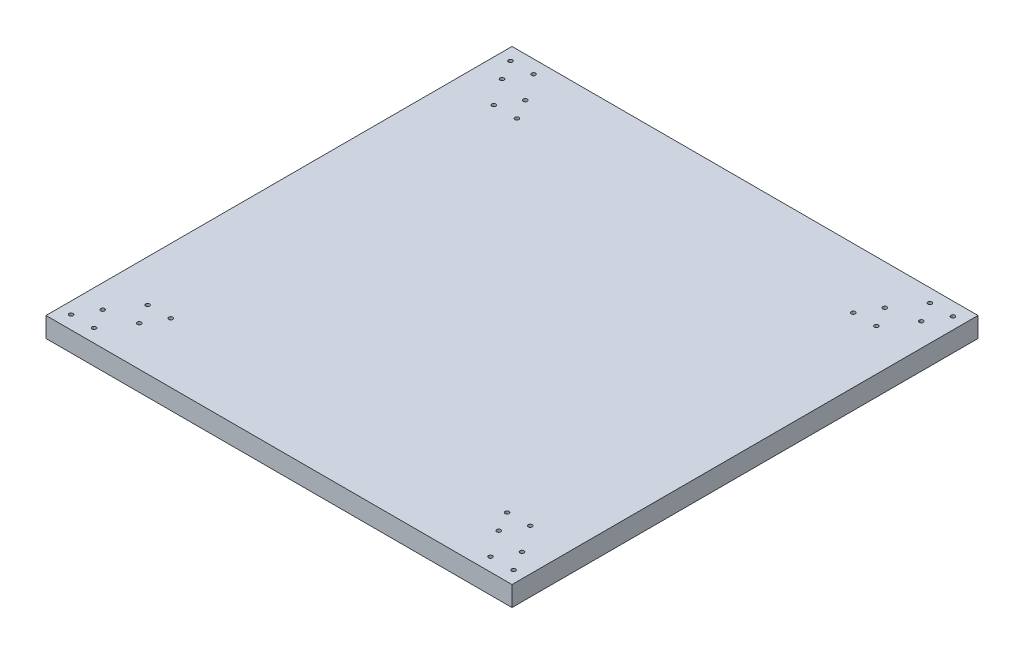
ISO-10303-21;
HEADER;
FILE_DESCRIPTION(('STEP AP214'),'2;1');
FILE_NAME('part.step','',(''),(''),'','','');
FILE_SCHEMA(('AUTOMOTIVE_DESIGN { 1 0 10303 214 1 1 1 1 }'));
ENDSEC;
DATA;
#1=APPLICATION_CONTEXT('core data for automotive mechanical design processes');
#2=APPLICATION_PROTOCOL_DEFINITION('international standard','automotive_design',2000,#1);
#3=PRODUCT_CONTEXT('',#1,'mechanical');
#4=PRODUCT('Part','Part','',(#3));
#5=PRODUCT_RELATED_PRODUCT_CATEGORY('part','',(#4));
#6=PRODUCT_DEFINITION_FORMATION('','',#4);
#7=PRODUCT_DEFINITION_CONTEXT('part definition',#1,'design');
#8=PRODUCT_DEFINITION('design','',#6,#7);
#9=PRODUCT_DEFINITION_SHAPE('','',#8);
#10=(LENGTH_UNIT() NAMED_UNIT(*) SI_UNIT(.MILLI.,.METRE.));
#11=(NAMED_UNIT(*) PLANE_ANGLE_UNIT() SI_UNIT($,.RADIAN.));
#12=(NAMED_UNIT(*) SI_UNIT($,.STERADIAN.) SOLID_ANGLE_UNIT());
#13=UNCERTAINTY_MEASURE_WITH_UNIT(LENGTH_MEASURE(1.E-05),#10,'distance_accuracy_value','');
#14=(GEOMETRIC_REPRESENTATION_CONTEXT(3) GLOBAL_UNCERTAINTY_ASSIGNED_CONTEXT((#13)) GLOBAL_UNIT_ASSIGNED_CONTEXT((#10,
#11,#12)) REPRESENTATION_CONTEXT('',''));
#15=CARTESIAN_POINT('',(0.,0.,0.));
#16=DIRECTION('',(0.,0.,1.));
#17=DIRECTION('',(1.,0.,0.));
#18=AXIS2_PLACEMENT_3D('',#15,#16,#17);
#19=CARTESIAN_POINT('',(0.,15.,0.));
#20=DIRECTION('',(0.,1.,0.));
#21=DIRECTION('',(0.,0.,1.));
#22=AXIS2_PLACEMENT_3D('',#19,#20,#21);
#23=PLANE('',#22);
#24=CARTESIAN_POINT('',(146.006098541866,15.,198.498659517427));
#25=DIRECTION('',(0.,1.,0.));
#26=DIRECTION('',(0.,0.,-1.));
#27=AXIS2_PLACEMENT_3D('',#24,#25,#26);
#28=CIRCLE('',#27,1.5);
#29=CARTESIAN_POINT('',(146.006098541866,15.,196.998659517427));
#30=VERTEX_POINT('',#29);
#31=EDGE_CURVE('E241',#30,#30,#28,.T.);
#32=ORIENTED_EDGE('',*,*,#31,.F.);
#33=EDGE_LOOP('',(#32));
#34=FACE_BOUND('',#33,.T.);
#35=CARTESIAN_POINT('',(-132.654155495978,15.,213.498659517426));
#36=DIRECTION('',(0.,1.,0.));
#37=DIRECTION('',(0.,0.,1.));
#38=AXIS2_PLACEMENT_3D('',#35,#36,#37);
#39=CIRCLE('',#38,1.5);
#40=CARTESIAN_POINT('',(-132.654155495978,15.,214.998659517426));
#41=VERTEX_POINT('',#40);
#42=EDGE_CURVE('E229',#41,#41,#39,.T.);
#43=ORIENTED_EDGE('',*,*,#42,.F.);
#44=EDGE_LOOP('',(#43));
#45=FACE_BOUND('',#44,.T.);
#46=CARTESIAN_POINT('',(146.006098541866,15.,-61.5013404825739));
#47=DIRECTION('',(0.,1.,0.));
#48=DIRECTION('',(0.,0.,1.));
#49=AXIS2_PLACEMENT_3D('',#46,#47,#48);
#50=CIRCLE('',#49,1.5);
#51=CARTESIAN_POINT('',(146.006098541866,15.,-60.0013404825739));
#52=VERTEX_POINT('',#51);
#53=EDGE_CURVE('E217',#52,#52,#50,.T.);
#54=ORIENTED_EDGE('',*,*,#53,.F.);
#55=EDGE_LOOP('',(#54));
#56=FACE_BOUND('',#55,.T.);
#57=CARTESIAN_POINT('',(137.345844504021,15.,-76.5013404825737));
#58=DIRECTION('',(0.,1.,0.));
#59=DIRECTION('',(0.,0.,1.));
#60=AXIS2_PLACEMENT_3D('',#57,#58,#59);
#61=CIRCLE('',#60,1.5);
#62=CARTESIAN_POINT('',(137.345844504021,15.,-75.0013404825737));
#63=VERTEX_POINT('',#62);
#64=EDGE_CURVE('E205',#63,#63,#61,.T.);
#65=ORIENTED_EDGE('',*,*,#64,.F.);
#66=EDGE_LOOP('',(#65));
#67=FACE_BOUND('',#66,.T.);
#68=CARTESIAN_POINT('',(-132.654155495979,15.,-76.5013404825737));
#69=DIRECTION('',(0.,1.,0.));
#70=DIRECTION('',(0.,0.,-1.));
#71=AXIS2_PLACEMENT_3D('',#68,#69,#70);
#72=CIRCLE('',#71,1.5);
#73=CARTESIAN_POINT('',(-132.654155495979,15.,-78.0013404825737));
#74=VERTEX_POINT('',#73);
#75=EDGE_CURVE('E193',#74,#74,#72,.T.);
#76=ORIENTED_EDGE('',*,*,#75,.F.);
#77=EDGE_LOOP('',(#76));
#78=FACE_BOUND('',#77,.T.);
#79=CARTESIAN_POINT('',(-123.993901458134,15.,-61.5013404825735));
#80=DIRECTION('',(0.,1.,0.));
#81=DIRECTION('',(0.,0.,-1.));
#82=AXIS2_PLACEMENT_3D('',#79,#80,#81);
#83=CIRCLE('',#82,1.49999999999999);
#84=CARTESIAN_POINT('',(-123.993901458134,15.,-63.0013404825735));
#85=VERTEX_POINT('',#84);
#86=EDGE_CURVE('E181',#85,#85,#83,.T.);
#87=ORIENTED_EDGE('',*,*,#86,.F.);
#88=EDGE_LOOP('',(#87));
#89=FACE_BOUND('',#88,.T.);
#90=CARTESIAN_POINT('',(-146.493901458134,15.,233.498659517426));
#91=DIRECTION('',(0.,1.,0.));
#92=DIRECTION('',(0.,0.,-1.));
#93=AXIS2_PLACEMENT_3D('',#90,#91,#92);
#94=CIRCLE('',#93,1.49999999999999);
#95=CARTESIAN_POINT('',(-146.493901458134,15.,231.998659517427));
#96=VERTEX_POINT('',#95);
#97=EDGE_CURVE('E169',#96,#96,#94,.T.);
#98=ORIENTED_EDGE('',*,*,#97,.F.);
#99=EDGE_LOOP('',(#98));
#100=FACE_BOUND('',#99,.T.);
#101=CARTESIAN_POINT('',(-155.154155495979,15.,-81.5013404825737));
#102=DIRECTION('',(0.,1.,0.));
#103=DIRECTION('',(0.,0.,1.));
#104=AXIS2_PLACEMENT_3D('',#101,#102,#103);
#105=CIRCLE('',#104,1.50000000000002);
#106=CARTESIAN_POINT('',(-155.154155495979,15.,-80.0013404825737));
#107=VERTEX_POINT('',#106);
#108=EDGE_CURVE('E157',#107,#107,#105,.T.);
#109=ORIENTED_EDGE('',*,*,#108,.F.);
#110=EDGE_LOOP('',(#109));
#111=FACE_BOUND('',#110,.T.);
#112=CARTESIAN_POINT('',(-163.814409533823,15.,-96.5013404825735));
#113=DIRECTION('',(0.,1.,0.));
#114=DIRECTION('',(0.,0.,1.));
#115=AXIS2_PLACEMENT_3D('',#112,#113,#114);
#116=CIRCLE('',#115,1.50000000000003);
#117=CARTESIAN_POINT('',(-163.814409533823,15.,-95.0013404825734));
#118=VERTEX_POINT('',#117);
#119=EDGE_CURVE('E145',#118,#118,#116,.T.);
#120=ORIENTED_EDGE('',*,*,#119,.F.);
#121=EDGE_LOOP('',(#120));
#122=FACE_BOUND('',#121,.T.);
#123=CARTESIAN_POINT('',(151.185590466177,15.,233.498659517426));
#124=DIRECTION('',(0.,1.,0.));
#125=DIRECTION('',(0.,0.,1.));
#126=AXIS2_PLACEMENT_3D('',#123,#124,#125);
#127=CIRCLE('',#126,1.49999999999999);
#128=CARTESIAN_POINT('',(151.185590466177,15.,234.998659517426));
#129=VERTEX_POINT('',#128);
#130=EDGE_CURVE('E133',#129,#129,#127,.T.);
#131=ORIENTED_EDGE('',*,*,#130,.F.);
#132=EDGE_LOOP('',(#131));
#133=FACE_BOUND('',#132,.T.);
#134=CARTESIAN_POINT('',(159.845844504021,15.,-81.5013404825737));
#135=DIRECTION('',(0.,1.,0.));
#136=DIRECTION('',(0.,0.,-1.));
#137=AXIS2_PLACEMENT_3D('',#134,#135,#136);
#138=CIRCLE('',#137,1.50000000000002);
#139=CARTESIAN_POINT('',(159.845844504021,15.,-83.0013404825737));
#140=VERTEX_POINT('',#139);
#141=EDGE_CURVE('E121',#140,#140,#138,.T.);
#142=ORIENTED_EDGE('',*,*,#141,.F.);
#143=EDGE_LOOP('',(#142));
#144=FACE_BOUND('',#143,.T.);
#145=CARTESIAN_POINT('',(159.845844504021,15.,218.498659517426));
#146=DIRECTION('',(0.,1.,0.));
#147=DIRECTION('',(0.,0.,1.));
#148=AXIS2_PLACEMENT_3D('',#145,#146,#147);
#149=CIRCLE('',#148,1.5);
#150=CARTESIAN_POINT('',(159.845844504021,15.,219.998659517426));
#151=VERTEX_POINT('',#150);
#152=EDGE_CURVE('E100',#151,#151,#149,.T.);
#153=ORIENTED_EDGE('',*,*,#152,.F.);
#154=EDGE_LOOP('',(#153));
#155=FACE_BOUND('',#154,.T.);
#156=DIRECTION('',(0.,0.,1.));
#157=VECTOR('',#156,1.);
#158=CARTESIAN_POINT('',(-172.654155495979,15.,-106.501340482574));
#159=LINE('',#158,#157);
#160=CARTESIAN_POINT('',(-172.654155495979,15.,-106.501340482574));
#161=VERTEX_POINT('',#160);
#162=CARTESIAN_POINT('',(-172.654155495979,15.,243.498659517426));
#163=VERTEX_POINT('',#162);
#164=EDGE_CURVE('E85',#161,#163,#159,.T.);
#165=ORIENTED_EDGE('',*,*,#164,.T.);
#166=DIRECTION('',(1.,0.,0.));
#167=VECTOR('',#166,1.);
#168=CARTESIAN_POINT('',(-172.654155495979,15.,243.498659517426));
#169=LINE('',#168,#167);
#170=CARTESIAN_POINT('',(177.345844504021,15.,243.498659517426));
#171=VERTEX_POINT('',#170);
#172=EDGE_CURVE('E80',#163,#171,#169,.T.);
#173=ORIENTED_EDGE('',*,*,#172,.T.);
#174=DIRECTION('',(0.,0.,-1.));
#175=VECTOR('',#174,1.);
#176=CARTESIAN_POINT('',(177.345844504021,15.,-106.501340482574));
#177=LINE('',#176,#175);
#178=CARTESIAN_POINT('',(177.345844504021,15.,-106.501340482574));
#179=VERTEX_POINT('',#178);
#180=EDGE_CURVE('E83',#171,#179,#177,.T.);
#181=ORIENTED_EDGE('',*,*,#180,.T.);
#182=DIRECTION('',(-1.,0.,0.));
#183=VECTOR('',#182,1.);
#184=CARTESIAN_POINT('',(-172.654155495979,15.,-106.501340482574));
#185=LINE('',#184,#183);
#186=EDGE_CURVE('E50',#179,#161,#185,.T.);
#187=ORIENTED_EDGE('',*,*,#186,.T.);
#188=EDGE_LOOP('',(#165,#173,#181,#187));
#189=FACE_BOUND('',#188,.T.);
#190=CARTESIAN_POINT('',(168.506098541866,15.,-96.5013404825735));
#191=DIRECTION('',(0.,1.,0.));
#192=DIRECTION('',(0.,0.,-1.));
#193=AXIS2_PLACEMENT_3D('',#190,#191,#192);
#194=CIRCLE('',#193,1.50000000000003);
#195=CARTESIAN_POINT('',(168.506098541866,15.,-98.0013404825735));
#196=VERTEX_POINT('',#195);
#197=EDGE_CURVE('E115',#196,#196,#194,.T.);
#198=ORIENTED_EDGE('',*,*,#197,.F.);
#199=EDGE_LOOP('',(#198));
#200=FACE_BOUND('',#199,.T.);
#201=CARTESIAN_POINT('',(168.506098541866,15.,233.498659517426));
#202=DIRECTION('',(0.,1.,0.));
#203=DIRECTION('',(0.,0.,1.));
#204=AXIS2_PLACEMENT_3D('',#201,#202,#203);
#205=CIRCLE('',#204,1.50000000000003);
#206=CARTESIAN_POINT('',(168.506098541866,15.,234.998659517426));
#207=VERTEX_POINT('',#206);
#208=EDGE_CURVE('E127',#207,#207,#205,.T.);
#209=ORIENTED_EDGE('',*,*,#208,.F.);
#210=EDGE_LOOP('',(#209));
#211=FACE_BOUND('',#210,.T.);
#212=CARTESIAN_POINT('',(151.185590466177,15.,-96.5013404825739));
#213=DIRECTION('',(0.,1.,0.));
#214=DIRECTION('',(0.,0.,-1.));
#215=AXIS2_PLACEMENT_3D('',#212,#213,#214);
#216=CIRCLE('',#215,1.49999999999997);
#217=CARTESIAN_POINT('',(151.185590466177,15.,-98.0013404825738));
#218=VERTEX_POINT('',#217);
#219=EDGE_CURVE('E139',#218,#218,#216,.T.);
#220=ORIENTED_EDGE('',*,*,#219,.F.);
#221=EDGE_LOOP('',(#220));
#222=FACE_BOUND('',#221,.T.);
#223=CARTESIAN_POINT('',(-146.493901458134,15.,-96.5013404825739));
#224=DIRECTION('',(0.,1.,0.));
#225=DIRECTION('',(0.,0.,1.));
#226=AXIS2_PLACEMENT_3D('',#223,#224,#225);
#227=CIRCLE('',#226,1.49999999999997);
#228=CARTESIAN_POINT('',(-146.493901458134,15.,-95.0013404825739));
#229=VERTEX_POINT('',#228);
#230=EDGE_CURVE('E151',#229,#229,#227,.T.);
#231=ORIENTED_EDGE('',*,*,#230,.F.);
#232=EDGE_LOOP('',(#231));
#233=FACE_BOUND('',#232,.T.);
#234=CARTESIAN_POINT('',(-155.154155495979,15.,218.498659517426));
#235=DIRECTION('',(0.,1.,0.));
#236=DIRECTION('',(0.,0.,-1.));
#237=AXIS2_PLACEMENT_3D('',#234,#235,#236);
#238=CIRCLE('',#237,1.5);
#239=CARTESIAN_POINT('',(-155.154155495979,15.,216.998659517426));
#240=VERTEX_POINT('',#239);
#241=EDGE_CURVE('E163',#240,#240,#238,.T.);
#242=ORIENTED_EDGE('',*,*,#241,.F.);
#243=EDGE_LOOP('',(#242));
#244=FACE_BOUND('',#243,.T.);
#245=CARTESIAN_POINT('',(-163.814409533823,15.,233.498659517426));
#246=DIRECTION('',(0.,1.,0.));
#247=DIRECTION('',(0.,0.,-1.));
#248=AXIS2_PLACEMENT_3D('',#245,#246,#247);
#249=CIRCLE('',#248,1.50000000000003);
#250=CARTESIAN_POINT('',(-163.814409533823,15.,231.998659517426));
#251=VERTEX_POINT('',#250);
#252=EDGE_CURVE('E175',#251,#251,#249,.T.);
#253=ORIENTED_EDGE('',*,*,#252,.F.);
#254=EDGE_LOOP('',(#253));
#255=FACE_BOUND('',#254,.T.);
#256=CARTESIAN_POINT('',(-141.314409533823,15.,-61.5013404825739));
#257=DIRECTION('',(0.,1.,0.));
#258=DIRECTION('',(0.,0.,-1.));
#259=AXIS2_PLACEMENT_3D('',#256,#257,#258);
#260=CIRCLE('',#259,1.5);
#261=CARTESIAN_POINT('',(-141.314409533823,15.,-63.0013404825739));
#262=VERTEX_POINT('',#261);
#263=EDGE_CURVE('E187',#262,#262,#260,.T.);
#264=ORIENTED_EDGE('',*,*,#263,.F.);
#265=EDGE_LOOP('',(#264));
#266=FACE_BOUND('',#265,.T.);
#267=CARTESIAN_POINT('',(-141.314409533823,15.,198.498659517427));
#268=DIRECTION('',(0.,1.,0.));
#269=DIRECTION('',(0.,0.,1.));
#270=AXIS2_PLACEMENT_3D('',#267,#268,#269);
#271=CIRCLE('',#270,1.5);
#272=CARTESIAN_POINT('',(-141.314409533823,15.,199.998659517427));
#273=VERTEX_POINT('',#272);
#274=EDGE_CURVE('E199',#273,#273,#271,.T.);
#275=ORIENTED_EDGE('',*,*,#274,.F.);
#276=EDGE_LOOP('',(#275));
#277=FACE_BOUND('',#276,.T.);
#278=CARTESIAN_POINT('',(-123.993901458134,15.,198.498659517426));
#279=DIRECTION('',(0.,1.,0.));
#280=DIRECTION('',(0.,0.,1.));
#281=AXIS2_PLACEMENT_3D('',#278,#279,#280);
#282=CIRCLE('',#281,1.49999999999999);
#283=CARTESIAN_POINT('',(-123.993901458134,15.,199.998659517426));
#284=VERTEX_POINT('',#283);
#285=EDGE_CURVE('E211',#284,#284,#282,.T.);
#286=ORIENTED_EDGE('',*,*,#285,.F.);
#287=EDGE_LOOP('',(#286));
#288=FACE_BOUND('',#287,.T.);
#289=CARTESIAN_POINT('',(128.685590466177,15.,-61.5013404825735));
#290=DIRECTION('',(0.,1.,0.));
#291=DIRECTION('',(0.,0.,1.));
#292=AXIS2_PLACEMENT_3D('',#289,#290,#291);
#293=CIRCLE('',#292,1.49999999999999);
#294=CARTESIAN_POINT('',(128.685590466177,15.,-60.0013404825735));
#295=VERTEX_POINT('',#294);
#296=EDGE_CURVE('E223',#295,#295,#293,.T.);
#297=ORIENTED_EDGE('',*,*,#296,.F.);
#298=EDGE_LOOP('',(#297));
#299=FACE_BOUND('',#298,.T.);
#300=CARTESIAN_POINT('',(128.685590466177,15.,198.498659517426));
#301=DIRECTION('',(0.,1.,0.));
#302=DIRECTION('',(0.,0.,-1.));
#303=AXIS2_PLACEMENT_3D('',#300,#301,#302);
#304=CIRCLE('',#303,1.49999999999999);
#305=CARTESIAN_POINT('',(128.685590466177,15.,196.998659517426));
#306=VERTEX_POINT('',#305);
#307=EDGE_CURVE('E235',#306,#306,#304,.T.);
#308=ORIENTED_EDGE('',*,*,#307,.F.);
#309=EDGE_LOOP('',(#308));
#310=FACE_BOUND('',#309,.T.);
#311=CARTESIAN_POINT('',(137.345844504022,15.,213.498659517426));
#312=DIRECTION('',(0.,1.,0.));
#313=DIRECTION('',(0.,0.,-1.));
#314=AXIS2_PLACEMENT_3D('',#311,#312,#313);
#315=CIRCLE('',#314,1.5);
#316=CARTESIAN_POINT('',(137.345844504022,15.,211.998659517426));
#317=VERTEX_POINT('',#316);
#318=EDGE_CURVE('E247',#317,#317,#315,.T.);
#319=ORIENTED_EDGE('',*,*,#318,.F.);
#320=EDGE_LOOP('',(#319));
#321=FACE_BOUND('',#320,.T.);
#322=ADVANCED_FACE('F33',(#34,#45,#56,#67,#78,#89,#100,#111,#122,#133,#144,#155,#189,#200,#211,
#222,#233,#244,#255,#266,#277,#288,#299,#310,#321),#23,.T.);
#323=CARTESIAN_POINT('',(0.,0.,0.));
#324=DIRECTION('',(0.,1.,0.));
#325=DIRECTION('',(0.,0.,1.));
#326=AXIS2_PLACEMENT_3D('',#323,#324,#325);
#327=PLANE('',#326);
#328=DIRECTION('',(0.,0.,1.));
#329=VECTOR('',#328,1.);
#330=CARTESIAN_POINT('',(-172.654155495979,0.,-106.501340482574));
#331=LINE('',#330,#329);
#332=CARTESIAN_POINT('',(-172.654155495979,0.,-106.501340482574));
#333=VERTEX_POINT('',#332);
#334=CARTESIAN_POINT('',(-172.654155495979,0.,243.498659517426));
#335=VERTEX_POINT('',#334);
#336=EDGE_CURVE('E97',#333,#335,#331,.T.);
#337=ORIENTED_EDGE('',*,*,#336,.F.);
#338=DIRECTION('',(-1.,0.,0.));
#339=VECTOR('',#338,1.);
#340=CARTESIAN_POINT('',(-172.654155495979,0.,-106.501340482574));
#341=LINE('',#340,#339);
#342=CARTESIAN_POINT('',(177.345844504021,0.,-106.501340482574));
#343=VERTEX_POINT('',#342);
#344=EDGE_CURVE('E73',#343,#333,#341,.T.);
#345=ORIENTED_EDGE('',*,*,#344,.F.);
#346=DIRECTION('',(0.,0.,-1.));
#347=VECTOR('',#346,1.);
#348=CARTESIAN_POINT('',(177.345844504021,0.,-106.501340482574));
#349=LINE('',#348,#347);
#350=CARTESIAN_POINT('',(177.345844504021,0.,243.498659517426));
#351=VERTEX_POINT('',#350);
#352=EDGE_CURVE('E67',#351,#343,#349,.T.);
#353=ORIENTED_EDGE('',*,*,#352,.F.);
#354=DIRECTION('',(1.,0.,0.));
#355=VECTOR('',#354,1.);
#356=CARTESIAN_POINT('',(-172.654155495979,0.,243.498659517426));
#357=LINE('',#356,#355);
#358=EDGE_CURVE('E89',#335,#351,#357,.T.);
#359=ORIENTED_EDGE('',*,*,#358,.F.);
#360=EDGE_LOOP('',(#337,#345,#353,#359));
#361=FACE_BOUND('',#360,.T.);
#362=CARTESIAN_POINT('',(159.845844504021,0.,218.498659517426));
#363=DIRECTION('',(0.,1.,0.));
#364=DIRECTION('',(0.,0.,1.));
#365=AXIS2_PLACEMENT_3D('',#362,#363,#364);
#366=CIRCLE('',#365,1.5);
#367=CARTESIAN_POINT('',(159.845844504021,0.,219.998659517426));
#368=VERTEX_POINT('',#367);
#369=EDGE_CURVE('E112',#368,#368,#366,.T.);
#370=ORIENTED_EDGE('',*,*,#369,.T.);
#371=EDGE_LOOP('',(#370));
#372=FACE_BOUND('',#371,.T.);
#373=CARTESIAN_POINT('',(168.506098541866,0.,-96.5013404825735));
#374=DIRECTION('',(0.,1.,0.));
#375=DIRECTION('',(0.,0.,-1.));
#376=AXIS2_PLACEMENT_3D('',#373,#374,#375);
#377=CIRCLE('',#376,1.50000000000003);
#378=CARTESIAN_POINT('',(168.506098541866,0.,-98.0013404825735));
#379=VERTEX_POINT('',#378);
#380=EDGE_CURVE('E118',#379,#379,#377,.T.);
#381=ORIENTED_EDGE('',*,*,#380,.T.);
#382=EDGE_LOOP('',(#381));
#383=FACE_BOUND('',#382,.T.);
#384=CARTESIAN_POINT('',(159.845844504021,0.,-81.5013404825737));
#385=DIRECTION('',(0.,1.,0.));
#386=DIRECTION('',(0.,0.,-1.));
#387=AXIS2_PLACEMENT_3D('',#384,#385,#386);
#388=CIRCLE('',#387,1.50000000000002);
#389=CARTESIAN_POINT('',(159.845844504021,0.,-83.0013404825737));
#390=VERTEX_POINT('',#389);
#391=EDGE_CURVE('E124',#390,#390,#388,.T.);
#392=ORIENTED_EDGE('',*,*,#391,.T.);
#393=EDGE_LOOP('',(#392));
#394=FACE_BOUND('',#393,.T.);
#395=CARTESIAN_POINT('',(168.506098541866,0.,233.498659517426));
#396=DIRECTION('',(0.,1.,0.));
#397=DIRECTION('',(0.,0.,1.));
#398=AXIS2_PLACEMENT_3D('',#395,#396,#397);
#399=CIRCLE('',#398,1.50000000000003);
#400=CARTESIAN_POINT('',(168.506098541866,0.,234.998659517426));
#401=VERTEX_POINT('',#400);
#402=EDGE_CURVE('E130',#401,#401,#399,.T.);
#403=ORIENTED_EDGE('',*,*,#402,.T.);
#404=EDGE_LOOP('',(#403));
#405=FACE_BOUND('',#404,.T.);
#406=CARTESIAN_POINT('',(151.185590466177,0.,233.498659517426));
#407=DIRECTION('',(0.,1.,0.));
#408=DIRECTION('',(0.,0.,1.));
#409=AXIS2_PLACEMENT_3D('',#406,#407,#408);
#410=CIRCLE('',#409,1.49999999999999);
#411=CARTESIAN_POINT('',(151.185590466177,0.,234.998659517426));
#412=VERTEX_POINT('',#411);
#413=EDGE_CURVE('E136',#412,#412,#410,.T.);
#414=ORIENTED_EDGE('',*,*,#413,.T.);
#415=EDGE_LOOP('',(#414));
#416=FACE_BOUND('',#415,.T.);
#417=CARTESIAN_POINT('',(151.185590466177,0.,-96.5013404825739));
#418=DIRECTION('',(0.,1.,0.));
#419=DIRECTION('',(0.,0.,-1.));
#420=AXIS2_PLACEMENT_3D('',#417,#418,#419);
#421=CIRCLE('',#420,1.49999999999997);
#422=CARTESIAN_POINT('',(151.185590466177,0.,-98.0013404825738));
#423=VERTEX_POINT('',#422);
#424=EDGE_CURVE('E142',#423,#423,#421,.T.);
#425=ORIENTED_EDGE('',*,*,#424,.T.);
#426=EDGE_LOOP('',(#425));
#427=FACE_BOUND('',#426,.T.);
#428=CARTESIAN_POINT('',(-163.814409533823,0.,-96.5013404825735));
#429=DIRECTION('',(0.,1.,0.));
#430=DIRECTION('',(0.,0.,1.));
#431=AXIS2_PLACEMENT_3D('',#428,#429,#430);
#432=CIRCLE('',#431,1.50000000000003);
#433=CARTESIAN_POINT('',(-163.814409533823,0.,-95.0013404825734));
#434=VERTEX_POINT('',#433);
#435=EDGE_CURVE('E148',#434,#434,#432,.T.);
#436=ORIENTED_EDGE('',*,*,#435,.T.);
#437=EDGE_LOOP('',(#436));
#438=FACE_BOUND('',#437,.T.);
#439=CARTESIAN_POINT('',(-146.493901458134,0.,-96.5013404825739));
#440=DIRECTION('',(0.,1.,0.));
#441=DIRECTION('',(0.,0.,1.));
#442=AXIS2_PLACEMENT_3D('',#439,#440,#441);
#443=CIRCLE('',#442,1.49999999999997);
#444=CARTESIAN_POINT('',(-146.493901458134,0.,-95.0013404825739));
#445=VERTEX_POINT('',#444);
#446=EDGE_CURVE('E154',#445,#445,#443,.T.);
#447=ORIENTED_EDGE('',*,*,#446,.T.);
#448=EDGE_LOOP('',(#447));
#449=FACE_BOUND('',#448,.T.);
#450=CARTESIAN_POINT('',(-155.154155495979,0.,-81.5013404825737));
#451=DIRECTION('',(0.,1.,0.));
#452=DIRECTION('',(0.,0.,1.));
#453=AXIS2_PLACEMENT_3D('',#450,#451,#452);
#454=CIRCLE('',#453,1.50000000000002);
#455=CARTESIAN_POINT('',(-155.154155495979,0.,-80.0013404825737));
#456=VERTEX_POINT('',#455);
#457=EDGE_CURVE('E160',#456,#456,#454,.T.);
#458=ORIENTED_EDGE('',*,*,#457,.T.);
#459=EDGE_LOOP('',(#458));
#460=FACE_BOUND('',#459,.T.);
#461=CARTESIAN_POINT('',(-155.154155495979,0.,218.498659517426));
#462=DIRECTION('',(0.,1.,0.));
#463=DIRECTION('',(0.,0.,-1.));
#464=AXIS2_PLACEMENT_3D('',#461,#462,#463);
#465=CIRCLE('',#464,1.5);
#466=CARTESIAN_POINT('',(-155.154155495979,0.,216.998659517426));
#467=VERTEX_POINT('',#466);
#468=EDGE_CURVE('E166',#467,#467,#465,.T.);
#469=ORIENTED_EDGE('',*,*,#468,.T.);
#470=EDGE_LOOP('',(#469));
#471=FACE_BOUND('',#470,.T.);
#472=CARTESIAN_POINT('',(-146.493901458134,0.,233.498659517426));
#473=DIRECTION('',(0.,1.,0.));
#474=DIRECTION('',(0.,0.,-1.));
#475=AXIS2_PLACEMENT_3D('',#472,#473,#474);
#476=CIRCLE('',#475,1.49999999999999);
#477=CARTESIAN_POINT('',(-146.493901458134,0.,231.998659517427));
#478=VERTEX_POINT('',#477);
#479=EDGE_CURVE('E172',#478,#478,#476,.T.);
#480=ORIENTED_EDGE('',*,*,#479,.T.);
#481=EDGE_LOOP('',(#480));
#482=FACE_BOUND('',#481,.T.);
#483=CARTESIAN_POINT('',(-163.814409533823,0.,233.498659517426));
#484=DIRECTION('',(0.,1.,0.));
#485=DIRECTION('',(0.,0.,-1.));
#486=AXIS2_PLACEMENT_3D('',#483,#484,#485);
#487=CIRCLE('',#486,1.50000000000003);
#488=CARTESIAN_POINT('',(-163.814409533823,0.,231.998659517426));
#489=VERTEX_POINT('',#488);
#490=EDGE_CURVE('E178',#489,#489,#487,.T.);
#491=ORIENTED_EDGE('',*,*,#490,.T.);
#492=EDGE_LOOP('',(#491));
#493=FACE_BOUND('',#492,.T.);
#494=CARTESIAN_POINT('',(-123.993901458134,0.,-61.5013404825735));
#495=DIRECTION('',(0.,1.,0.));
#496=DIRECTION('',(0.,0.,-1.));
#497=AXIS2_PLACEMENT_3D('',#494,#495,#496);
#498=CIRCLE('',#497,1.49999999999999);
#499=CARTESIAN_POINT('',(-123.993901458134,0.,-63.0013404825735));
#500=VERTEX_POINT('',#499);
#501=EDGE_CURVE('E184',#500,#500,#498,.T.);
#502=ORIENTED_EDGE('',*,*,#501,.T.);
#503=EDGE_LOOP('',(#502));
#504=FACE_BOUND('',#503,.T.);
#505=CARTESIAN_POINT('',(-141.314409533823,0.,-61.5013404825739));
#506=DIRECTION('',(0.,1.,0.));
#507=DIRECTION('',(0.,0.,-1.));
#508=AXIS2_PLACEMENT_3D('',#505,#506,#507);
#509=CIRCLE('',#508,1.5);
#510=CARTESIAN_POINT('',(-141.314409533823,0.,-63.0013404825739));
#511=VERTEX_POINT('',#510);
#512=EDGE_CURVE('E190',#511,#511,#509,.T.);
#513=ORIENTED_EDGE('',*,*,#512,.T.);
#514=EDGE_LOOP('',(#513));
#515=FACE_BOUND('',#514,.T.);
#516=CARTESIAN_POINT('',(-132.654155495979,0.,-76.5013404825737));
#517=DIRECTION('',(0.,1.,0.));
#518=DIRECTION('',(0.,0.,-1.));
#519=AXIS2_PLACEMENT_3D('',#516,#517,#518);
#520=CIRCLE('',#519,1.5);
#521=CARTESIAN_POINT('',(-132.654155495979,0.,-78.0013404825737));
#522=VERTEX_POINT('',#521);
#523=EDGE_CURVE('E196',#522,#522,#520,.T.);
#524=ORIENTED_EDGE('',*,*,#523,.T.);
#525=EDGE_LOOP('',(#524));
#526=FACE_BOUND('',#525,.T.);
#527=CARTESIAN_POINT('',(-141.314409533823,0.,198.498659517427));
#528=DIRECTION('',(0.,1.,0.));
#529=DIRECTION('',(0.,0.,1.));
#530=AXIS2_PLACEMENT_3D('',#527,#528,#529);
#531=CIRCLE('',#530,1.5);
#532=CARTESIAN_POINT('',(-141.314409533823,0.,199.998659517427));
#533=VERTEX_POINT('',#532);
#534=EDGE_CURVE('E202',#533,#533,#531,.T.);
#535=ORIENTED_EDGE('',*,*,#534,.T.);
#536=EDGE_LOOP('',(#535));
#537=FACE_BOUND('',#536,.T.);
#538=CARTESIAN_POINT('',(137.345844504021,0.,-76.5013404825737));
#539=DIRECTION('',(0.,1.,0.));
#540=DIRECTION('',(0.,0.,1.));
#541=AXIS2_PLACEMENT_3D('',#538,#539,#540);
#542=CIRCLE('',#541,1.5);
#543=CARTESIAN_POINT('',(137.345844504021,0.,-75.0013404825737));
#544=VERTEX_POINT('',#543);
#545=EDGE_CURVE('E208',#544,#544,#542,.T.);
#546=ORIENTED_EDGE('',*,*,#545,.T.);
#547=EDGE_LOOP('',(#546));
#548=FACE_BOUND('',#547,.T.);
#549=CARTESIAN_POINT('',(-123.993901458134,0.,198.498659517426));
#550=DIRECTION('',(0.,1.,0.));
#551=DIRECTION('',(0.,0.,1.));
#552=AXIS2_PLACEMENT_3D('',#549,#550,#551);
#553=CIRCLE('',#552,1.49999999999999);
#554=CARTESIAN_POINT('',(-123.993901458134,0.,199.998659517426));
#555=VERTEX_POINT('',#554);
#556=EDGE_CURVE('E214',#555,#555,#553,.T.);
#557=ORIENTED_EDGE('',*,*,#556,.T.);
#558=EDGE_LOOP('',(#557));
#559=FACE_BOUND('',#558,.T.);
#560=CARTESIAN_POINT('',(146.006098541866,0.,-61.5013404825739));
#561=DIRECTION('',(0.,1.,0.));
#562=DIRECTION('',(0.,0.,1.));
#563=AXIS2_PLACEMENT_3D('',#560,#561,#562);
#564=CIRCLE('',#563,1.5);
#565=CARTESIAN_POINT('',(146.006098541866,0.,-60.0013404825739));
#566=VERTEX_POINT('',#565);
#567=EDGE_CURVE('E220',#566,#566,#564,.T.);
#568=ORIENTED_EDGE('',*,*,#567,.T.);
#569=EDGE_LOOP('',(#568));
#570=FACE_BOUND('',#569,.T.);
#571=CARTESIAN_POINT('',(128.685590466177,0.,-61.5013404825735));
#572=DIRECTION('',(0.,1.,0.));
#573=DIRECTION('',(0.,0.,1.));
#574=AXIS2_PLACEMENT_3D('',#571,#572,#573);
#575=CIRCLE('',#574,1.49999999999999);
#576=CARTESIAN_POINT('',(128.685590466177,0.,-60.0013404825735));
#577=VERTEX_POINT('',#576);
#578=EDGE_CURVE('E226',#577,#577,#575,.T.);
#579=ORIENTED_EDGE('',*,*,#578,.T.);
#580=EDGE_LOOP('',(#579));
#581=FACE_BOUND('',#580,.T.);
#582=CARTESIAN_POINT('',(-132.654155495978,0.,213.498659517426));
#583=DIRECTION('',(0.,1.,0.));
#584=DIRECTION('',(0.,0.,1.));
#585=AXIS2_PLACEMENT_3D('',#582,#583,#584);
#586=CIRCLE('',#585,1.5);
#587=CARTESIAN_POINT('',(-132.654155495978,0.,214.998659517426));
#588=VERTEX_POINT('',#587);
#589=EDGE_CURVE('E232',#588,#588,#586,.T.);
#590=ORIENTED_EDGE('',*,*,#589,.T.);
#591=EDGE_LOOP('',(#590));
#592=FACE_BOUND('',#591,.T.);
#593=CARTESIAN_POINT('',(128.685590466177,0.,198.498659517426));
#594=DIRECTION('',(0.,1.,0.));
#595=DIRECTION('',(0.,0.,-1.));
#596=AXIS2_PLACEMENT_3D('',#593,#594,#595);
#597=CIRCLE('',#596,1.49999999999999);
#598=CARTESIAN_POINT('',(128.685590466177,0.,196.998659517426));
#599=VERTEX_POINT('',#598);
#600=EDGE_CURVE('E238',#599,#599,#597,.T.);
#601=ORIENTED_EDGE('',*,*,#600,.T.);
#602=EDGE_LOOP('',(#601));
#603=FACE_BOUND('',#602,.T.);
#604=CARTESIAN_POINT('',(146.006098541866,0.,198.498659517427));
#605=DIRECTION('',(0.,1.,0.));
#606=DIRECTION('',(0.,0.,-1.));
#607=AXIS2_PLACEMENT_3D('',#604,#605,#606);
#608=CIRCLE('',#607,1.5);
#609=CARTESIAN_POINT('',(146.006098541866,0.,196.998659517427));
#610=VERTEX_POINT('',#609);
#611=EDGE_CURVE('E244',#610,#610,#608,.T.);
#612=ORIENTED_EDGE('',*,*,#611,.T.);
#613=EDGE_LOOP('',(#612));
#614=FACE_BOUND('',#613,.T.);
#615=CARTESIAN_POINT('',(137.345844504022,0.,213.498659517426));
#616=DIRECTION('',(0.,1.,0.));
#617=DIRECTION('',(0.,0.,-1.));
#618=AXIS2_PLACEMENT_3D('',#615,#616,#617);
#619=CIRCLE('',#618,1.5);
#620=CARTESIAN_POINT('',(137.345844504022,0.,211.998659517426));
#621=VERTEX_POINT('',#620);
#622=EDGE_CURVE('E250',#621,#621,#619,.T.);
#623=ORIENTED_EDGE('',*,*,#622,.T.);
#624=EDGE_LOOP('',(#623));
#625=FACE_BOUND('',#624,.T.);
#626=ADVANCED_FACE('F108',(#361,#372,#383,#394,#405,#416,#427,#438,#449,#460,#471,#482,#493,
#504,#515,#526,#537,#548,#559,#570,#581,#592,#603,#614,#625),#327,.F.);
#627=CARTESIAN_POINT('',(-172.654155495979,15.,-106.501340482574));
#628=DIRECTION('',(1.,0.,0.));
#629=DIRECTION('',(0.,0.,-1.));
#630=AXIS2_PLACEMENT_3D('',#627,#628,#629);
#631=PLANE('',#630);
#632=ORIENTED_EDGE('',*,*,#336,.T.);
#633=DIRECTION('',(0.,-1.,0.));
#634=VECTOR('',#633,1.);
#635=CARTESIAN_POINT('',(-172.654155495979,15.,243.498659517426));
#636=LINE('',#635,#634);
#637=EDGE_CURVE('E11',#163,#335,#636,.T.);
#638=ORIENTED_EDGE('',*,*,#637,.F.);
#639=ORIENTED_EDGE('',*,*,#164,.F.);
#640=DIRECTION('',(0.,-1.,0.));
#641=VECTOR('',#640,1.);
#642=CARTESIAN_POINT('',(-172.654155495979,15.,-106.501340482574));
#643=LINE('',#642,#641);
#644=EDGE_CURVE('E93',#161,#333,#643,.T.);
#645=ORIENTED_EDGE('',*,*,#644,.T.);
#646=EDGE_LOOP('',(#632,#638,#639,#645));
#647=FACE_BOUND('',#646,.T.);
#648=ADVANCED_FACE('F35',(#647),#631,.F.);
#649=CARTESIAN_POINT('',(-172.654155495979,15.,243.498659517426));
#650=DIRECTION('',(0.,0.,-1.));
#651=DIRECTION('',(-1.,0.,0.));
#652=AXIS2_PLACEMENT_3D('',#649,#650,#651);
#653=PLANE('',#652);
#654=ORIENTED_EDGE('',*,*,#358,.T.);
#655=DIRECTION('',(0.,-1.,0.));
#656=VECTOR('',#655,1.);
#657=CARTESIAN_POINT('',(177.345844504021,15.,243.498659517426));
#658=LINE('',#657,#656);
#659=EDGE_CURVE('E42',#171,#351,#658,.T.);
#660=ORIENTED_EDGE('',*,*,#659,.F.);
#661=ORIENTED_EDGE('',*,*,#172,.F.);
#662=ORIENTED_EDGE('',*,*,#637,.T.);
#663=EDGE_LOOP('',(#654,#660,#661,#662));
#664=FACE_BOUND('',#663,.T.);
#665=ADVANCED_FACE('F88',(#664),#653,.F.);
#666=CARTESIAN_POINT('',(177.345844504021,15.,-106.501340482574));
#667=DIRECTION('',(-1.,0.,0.));
#668=DIRECTION('',(0.,0.,1.));
#669=AXIS2_PLACEMENT_3D('',#666,#667,#668);
#670=PLANE('',#669);
#671=ORIENTED_EDGE('',*,*,#352,.T.);
#672=DIRECTION('',(0.,-1.,0.));
#673=VECTOR('',#672,1.);
#674=CARTESIAN_POINT('',(177.345844504021,15.,-106.501340482574));
#675=LINE('',#674,#673);
#676=EDGE_CURVE('E90',#179,#343,#675,.T.);
#677=ORIENTED_EDGE('',*,*,#676,.F.);
#678=ORIENTED_EDGE('',*,*,#180,.F.);
#679=ORIENTED_EDGE('',*,*,#659,.T.);
#680=EDGE_LOOP('',(#671,#677,#678,#679));
#681=FACE_BOUND('',#680,.T.);
#682=ADVANCED_FACE('F91',(#681),#670,.F.);
#683=CARTESIAN_POINT('',(-172.654155495979,15.,-106.501340482574));
#684=DIRECTION('',(0.,0.,1.));
#685=DIRECTION('',(1.,0.,0.));
#686=AXIS2_PLACEMENT_3D('',#683,#684,#685);
#687=PLANE('',#686);
#688=ORIENTED_EDGE('',*,*,#344,.T.);
#689=ORIENTED_EDGE('',*,*,#644,.F.);
#690=ORIENTED_EDGE('',*,*,#186,.F.);
#691=ORIENTED_EDGE('',*,*,#676,.T.);
#692=EDGE_LOOP('',(#688,#689,#690,#691));
#693=FACE_BOUND('',#692,.T.);
#694=ADVANCED_FACE('F105',(#693),#687,.F.);
#695=CARTESIAN_POINT('',(159.845844504021,15.,218.498659517426));
#696=DIRECTION('',(0.,-1.,0.));
#697=DIRECTION('',(0.,0.,-1.));
#698=AXIS2_PLACEMENT_3D('',#695,#696,#697);
#699=CYLINDRICAL_SURFACE('',#698,1.5);
#700=ORIENTED_EDGE('',*,*,#152,.T.);
#701=EDGE_LOOP('',(#700));
#702=FACE_BOUND('',#701,.T.);
#703=ORIENTED_EDGE('',*,*,#369,.F.);
#704=EDGE_LOOP('',(#703));
#705=FACE_BOUND('',#704,.T.);
#706=ADVANCED_FACE('F269',(#702,#705),#699,.F.);
#707=CARTESIAN_POINT('',(168.506098541866,15.,-96.5013404825735));
#708=DIRECTION('',(0.,-1.,0.));
#709=DIRECTION('',(0.,0.,-1.));
#710=AXIS2_PLACEMENT_3D('',#707,#708,#709);
#711=CYLINDRICAL_SURFACE('',#710,1.50000000000003);
#712=ORIENTED_EDGE('',*,*,#197,.T.);
#713=EDGE_LOOP('',(#712));
#714=FACE_BOUND('',#713,.T.);
#715=ORIENTED_EDGE('',*,*,#380,.F.);
#716=EDGE_LOOP('',(#715));
#717=FACE_BOUND('',#716,.T.);
#718=ADVANCED_FACE('F315',(#714,#717),#711,.F.);
#719=CARTESIAN_POINT('',(159.845844504021,15.,-81.5013404825737));
#720=DIRECTION('',(0.,-1.,0.));
#721=DIRECTION('',(0.,0.,-1.));
#722=AXIS2_PLACEMENT_3D('',#719,#720,#721);
#723=CYLINDRICAL_SURFACE('',#722,1.50000000000002);
#724=ORIENTED_EDGE('',*,*,#141,.T.);
#725=EDGE_LOOP('',(#724));
#726=FACE_BOUND('',#725,.T.);
#727=ORIENTED_EDGE('',*,*,#391,.F.);
#728=EDGE_LOOP('',(#727));
#729=FACE_BOUND('',#728,.T.);
#730=ADVANCED_FACE('F323',(#726,#729),#723,.F.);
#731=CARTESIAN_POINT('',(168.506098541866,15.,233.498659517426));
#732=DIRECTION('',(0.,-1.,0.));
#733=DIRECTION('',(0.,0.,-1.));
#734=AXIS2_PLACEMENT_3D('',#731,#732,#733);
#735=CYLINDRICAL_SURFACE('',#734,1.50000000000003);
#736=ORIENTED_EDGE('',*,*,#208,.T.);
#737=EDGE_LOOP('',(#736));
#738=FACE_BOUND('',#737,.T.);
#739=ORIENTED_EDGE('',*,*,#402,.F.);
#740=EDGE_LOOP('',(#739));
#741=FACE_BOUND('',#740,.T.);
#742=ADVANCED_FACE('F331',(#738,#741),#735,.F.);
#743=CARTESIAN_POINT('',(151.185590466177,15.,233.498659517426));
#744=DIRECTION('',(0.,-1.,0.));
#745=DIRECTION('',(0.,0.,-1.));
#746=AXIS2_PLACEMENT_3D('',#743,#744,#745);
#747=CYLINDRICAL_SURFACE('',#746,1.49999999999999);
#748=ORIENTED_EDGE('',*,*,#130,.T.);
#749=EDGE_LOOP('',(#748));
#750=FACE_BOUND('',#749,.T.);
#751=ORIENTED_EDGE('',*,*,#413,.F.);
#752=EDGE_LOOP('',(#751));
#753=FACE_BOUND('',#752,.T.);
#754=ADVANCED_FACE('F340',(#750,#753),#747,.F.);
#755=CARTESIAN_POINT('',(151.185590466177,15.,-96.5013404825739));
#756=DIRECTION('',(0.,-1.,0.));
#757=DIRECTION('',(0.,0.,-1.));
#758=AXIS2_PLACEMENT_3D('',#755,#756,#757);
#759=CYLINDRICAL_SURFACE('',#758,1.49999999999997);
#760=ORIENTED_EDGE('',*,*,#219,.T.);
#761=EDGE_LOOP('',(#760));
#762=FACE_BOUND('',#761,.T.);
#763=ORIENTED_EDGE('',*,*,#424,.F.);
#764=EDGE_LOOP('',(#763));
#765=FACE_BOUND('',#764,.T.);
#766=ADVANCED_FACE('F349',(#762,#765),#759,.F.);
#767=CARTESIAN_POINT('',(-163.814409533823,15.,-96.5013404825735));
#768=DIRECTION('',(0.,-1.,0.));
#769=DIRECTION('',(0.,0.,-1.));
#770=AXIS2_PLACEMENT_3D('',#767,#768,#769);
#771=CYLINDRICAL_SURFACE('',#770,1.50000000000003);
#772=ORIENTED_EDGE('',*,*,#119,.T.);
#773=EDGE_LOOP('',(#772));
#774=FACE_BOUND('',#773,.T.);
#775=ORIENTED_EDGE('',*,*,#435,.F.);
#776=EDGE_LOOP('',(#775));
#777=FACE_BOUND('',#776,.T.);
#778=ADVANCED_FACE('F358',(#774,#777),#771,.F.);
#779=CARTESIAN_POINT('',(-146.493901458134,15.,-96.5013404825739));
#780=DIRECTION('',(0.,-1.,0.));
#781=DIRECTION('',(0.,0.,-1.));
#782=AXIS2_PLACEMENT_3D('',#779,#780,#781);
#783=CYLINDRICAL_SURFACE('',#782,1.49999999999997);
#784=ORIENTED_EDGE('',*,*,#230,.T.);
#785=EDGE_LOOP('',(#784));
#786=FACE_BOUND('',#785,.T.);
#787=ORIENTED_EDGE('',*,*,#446,.F.);
#788=EDGE_LOOP('',(#787));
#789=FACE_BOUND('',#788,.T.);
#790=ADVANCED_FACE('F367',(#786,#789),#783,.F.);
#791=CARTESIAN_POINT('',(-155.154155495979,15.,-81.5013404825737));
#792=DIRECTION('',(0.,-1.,0.));
#793=DIRECTION('',(0.,0.,-1.));
#794=AXIS2_PLACEMENT_3D('',#791,#792,#793);
#795=CYLINDRICAL_SURFACE('',#794,1.50000000000002);
#796=ORIENTED_EDGE('',*,*,#108,.T.);
#797=EDGE_LOOP('',(#796));
#798=FACE_BOUND('',#797,.T.);
#799=ORIENTED_EDGE('',*,*,#457,.F.);
#800=EDGE_LOOP('',(#799));
#801=FACE_BOUND('',#800,.T.);
#802=ADVANCED_FACE('F376',(#798,#801),#795,.F.);
#803=CARTESIAN_POINT('',(-155.154155495979,15.,218.498659517426));
#804=DIRECTION('',(0.,-1.,0.));
#805=DIRECTION('',(0.,0.,-1.));
#806=AXIS2_PLACEMENT_3D('',#803,#804,#805);
#807=CYLINDRICAL_SURFACE('',#806,1.5);
#808=ORIENTED_EDGE('',*,*,#241,.T.);
#809=EDGE_LOOP('',(#808));
#810=FACE_BOUND('',#809,.T.);
#811=ORIENTED_EDGE('',*,*,#468,.F.);
#812=EDGE_LOOP('',(#811));
#813=FACE_BOUND('',#812,.T.);
#814=ADVANCED_FACE('F385',(#810,#813),#807,.F.);
#815=CARTESIAN_POINT('',(-146.493901458134,15.,233.498659517426));
#816=DIRECTION('',(0.,-1.,0.));
#817=DIRECTION('',(0.,0.,-1.));
#818=AXIS2_PLACEMENT_3D('',#815,#816,#817);
#819=CYLINDRICAL_SURFACE('',#818,1.49999999999999);
#820=ORIENTED_EDGE('',*,*,#97,.T.);
#821=EDGE_LOOP('',(#820));
#822=FACE_BOUND('',#821,.T.);
#823=ORIENTED_EDGE('',*,*,#479,.F.);
#824=EDGE_LOOP('',(#823));
#825=FACE_BOUND('',#824,.T.);
#826=ADVANCED_FACE('F394',(#822,#825),#819,.F.);
#827=CARTESIAN_POINT('',(-163.814409533823,15.,233.498659517426));
#828=DIRECTION('',(0.,-1.,0.));
#829=DIRECTION('',(0.,0.,-1.));
#830=AXIS2_PLACEMENT_3D('',#827,#828,#829);
#831=CYLINDRICAL_SURFACE('',#830,1.50000000000003);
#832=ORIENTED_EDGE('',*,*,#252,.T.);
#833=EDGE_LOOP('',(#832));
#834=FACE_BOUND('',#833,.T.);
#835=ORIENTED_EDGE('',*,*,#490,.F.);
#836=EDGE_LOOP('',(#835));
#837=FACE_BOUND('',#836,.T.);
#838=ADVANCED_FACE('F403',(#834,#837),#831,.F.);
#839=CARTESIAN_POINT('',(-123.993901458134,15.,-61.5013404825735));
#840=DIRECTION('',(0.,-1.,0.));
#841=DIRECTION('',(0.,0.,-1.));
#842=AXIS2_PLACEMENT_3D('',#839,#840,#841);
#843=CYLINDRICAL_SURFACE('',#842,1.49999999999999);
#844=ORIENTED_EDGE('',*,*,#86,.T.);
#845=EDGE_LOOP('',(#844));
#846=FACE_BOUND('',#845,.T.);
#847=ORIENTED_EDGE('',*,*,#501,.F.);
#848=EDGE_LOOP('',(#847));
#849=FACE_BOUND('',#848,.T.);
#850=ADVANCED_FACE('F412',(#846,#849),#843,.F.);
#851=CARTESIAN_POINT('',(-141.314409533823,15.,-61.5013404825739));
#852=DIRECTION('',(0.,-1.,0.));
#853=DIRECTION('',(0.,0.,-1.));
#854=AXIS2_PLACEMENT_3D('',#851,#852,#853);
#855=CYLINDRICAL_SURFACE('',#854,1.5);
#856=ORIENTED_EDGE('',*,*,#263,.T.);
#857=EDGE_LOOP('',(#856));
#858=FACE_BOUND('',#857,.T.);
#859=ORIENTED_EDGE('',*,*,#512,.F.);
#860=EDGE_LOOP('',(#859));
#861=FACE_BOUND('',#860,.T.);
#862=ADVANCED_FACE('F421',(#858,#861),#855,.F.);
#863=CARTESIAN_POINT('',(-132.654155495979,15.,-76.5013404825737));
#864=DIRECTION('',(0.,-1.,0.));
#865=DIRECTION('',(0.,0.,-1.));
#866=AXIS2_PLACEMENT_3D('',#863,#864,#865);
#867=CYLINDRICAL_SURFACE('',#866,1.5);
#868=ORIENTED_EDGE('',*,*,#75,.T.);
#869=EDGE_LOOP('',(#868));
#870=FACE_BOUND('',#869,.T.);
#871=ORIENTED_EDGE('',*,*,#523,.F.);
#872=EDGE_LOOP('',(#871));
#873=FACE_BOUND('',#872,.T.);
#874=ADVANCED_FACE('F430',(#870,#873),#867,.F.);
#875=CARTESIAN_POINT('',(-141.314409533823,15.,198.498659517427));
#876=DIRECTION('',(0.,-1.,0.));
#877=DIRECTION('',(0.,0.,-1.));
#878=AXIS2_PLACEMENT_3D('',#875,#876,#877);
#879=CYLINDRICAL_SURFACE('',#878,1.5);
#880=ORIENTED_EDGE('',*,*,#274,.T.);
#881=EDGE_LOOP('',(#880));
#882=FACE_BOUND('',#881,.T.);
#883=ORIENTED_EDGE('',*,*,#534,.F.);
#884=EDGE_LOOP('',(#883));
#885=FACE_BOUND('',#884,.T.);
#886=ADVANCED_FACE('F439',(#882,#885),#879,.F.);
#887=CARTESIAN_POINT('',(137.345844504021,15.,-76.5013404825737));
#888=DIRECTION('',(0.,-1.,0.));
#889=DIRECTION('',(0.,0.,-1.));
#890=AXIS2_PLACEMENT_3D('',#887,#888,#889);
#891=CYLINDRICAL_SURFACE('',#890,1.5);
#892=ORIENTED_EDGE('',*,*,#64,.T.);
#893=EDGE_LOOP('',(#892));
#894=FACE_BOUND('',#893,.T.);
#895=ORIENTED_EDGE('',*,*,#545,.F.);
#896=EDGE_LOOP('',(#895));
#897=FACE_BOUND('',#896,.T.);
#898=ADVANCED_FACE('F448',(#894,#897),#891,.F.);
#899=CARTESIAN_POINT('',(-123.993901458134,15.,198.498659517426));
#900=DIRECTION('',(0.,-1.,0.));
#901=DIRECTION('',(0.,0.,-1.));
#902=AXIS2_PLACEMENT_3D('',#899,#900,#901);
#903=CYLINDRICAL_SURFACE('',#902,1.49999999999999);
#904=ORIENTED_EDGE('',*,*,#285,.T.);
#905=EDGE_LOOP('',(#904));
#906=FACE_BOUND('',#905,.T.);
#907=ORIENTED_EDGE('',*,*,#556,.F.);
#908=EDGE_LOOP('',(#907));
#909=FACE_BOUND('',#908,.T.);
#910=ADVANCED_FACE('F457',(#906,#909),#903,.F.);
#911=CARTESIAN_POINT('',(146.006098541866,15.,-61.5013404825739));
#912=DIRECTION('',(0.,-1.,0.));
#913=DIRECTION('',(0.,0.,-1.));
#914=AXIS2_PLACEMENT_3D('',#911,#912,#913);
#915=CYLINDRICAL_SURFACE('',#914,1.5);
#916=ORIENTED_EDGE('',*,*,#53,.T.);
#917=EDGE_LOOP('',(#916));
#918=FACE_BOUND('',#917,.T.);
#919=ORIENTED_EDGE('',*,*,#567,.F.);
#920=EDGE_LOOP('',(#919));
#921=FACE_BOUND('',#920,.T.);
#922=ADVANCED_FACE('F466',(#918,#921),#915,.F.);
#923=CARTESIAN_POINT('',(128.685590466177,15.,-61.5013404825735));
#924=DIRECTION('',(0.,-1.,0.));
#925=DIRECTION('',(0.,0.,-1.));
#926=AXIS2_PLACEMENT_3D('',#923,#924,#925);
#927=CYLINDRICAL_SURFACE('',#926,1.49999999999999);
#928=ORIENTED_EDGE('',*,*,#296,.T.);
#929=EDGE_LOOP('',(#928));
#930=FACE_BOUND('',#929,.T.);
#931=ORIENTED_EDGE('',*,*,#578,.F.);
#932=EDGE_LOOP('',(#931));
#933=FACE_BOUND('',#932,.T.);
#934=ADVANCED_FACE('F475',(#930,#933),#927,.F.);
#935=CARTESIAN_POINT('',(-132.654155495978,15.,213.498659517426));
#936=DIRECTION('',(0.,-1.,0.));
#937=DIRECTION('',(0.,0.,-1.));
#938=AXIS2_PLACEMENT_3D('',#935,#936,#937);
#939=CYLINDRICAL_SURFACE('',#938,1.5);
#940=ORIENTED_EDGE('',*,*,#42,.T.);
#941=EDGE_LOOP('',(#940));
#942=FACE_BOUND('',#941,.T.);
#943=ORIENTED_EDGE('',*,*,#589,.F.);
#944=EDGE_LOOP('',(#943));
#945=FACE_BOUND('',#944,.T.);
#946=ADVANCED_FACE('F484',(#942,#945),#939,.F.);
#947=CARTESIAN_POINT('',(128.685590466177,15.,198.498659517426));
#948=DIRECTION('',(0.,-1.,0.));
#949=DIRECTION('',(0.,0.,-1.));
#950=AXIS2_PLACEMENT_3D('',#947,#948,#949);
#951=CYLINDRICAL_SURFACE('',#950,1.49999999999999);
#952=ORIENTED_EDGE('',*,*,#307,.T.);
#953=EDGE_LOOP('',(#952));
#954=FACE_BOUND('',#953,.T.);
#955=ORIENTED_EDGE('',*,*,#600,.F.);
#956=EDGE_LOOP('',(#955));
#957=FACE_BOUND('',#956,.T.);
#958=ADVANCED_FACE('F493',(#954,#957),#951,.F.);
#959=CARTESIAN_POINT('',(146.006098541866,15.,198.498659517427));
#960=DIRECTION('',(0.,-1.,0.));
#961=DIRECTION('',(0.,0.,-1.));
#962=AXIS2_PLACEMENT_3D('',#959,#960,#961);
#963=CYLINDRICAL_SURFACE('',#962,1.5);
#964=ORIENTED_EDGE('',*,*,#31,.T.);
#965=EDGE_LOOP('',(#964));
#966=FACE_BOUND('',#965,.T.);
#967=ORIENTED_EDGE('',*,*,#611,.F.);
#968=EDGE_LOOP('',(#967));
#969=FACE_BOUND('',#968,.T.);
#970=ADVANCED_FACE('F502',(#966,#969),#963,.F.);
#971=CARTESIAN_POINT('',(137.345844504022,15.,213.498659517426));
#972=DIRECTION('',(0.,-1.,0.));
#973=DIRECTION('',(0.,0.,-1.));
#974=AXIS2_PLACEMENT_3D('',#971,#972,#973);
#975=CYLINDRICAL_SURFACE('',#974,1.5);
#976=ORIENTED_EDGE('',*,*,#318,.T.);
#977=EDGE_LOOP('',(#976));
#978=FACE_BOUND('',#977,.T.);
#979=ORIENTED_EDGE('',*,*,#622,.F.);
#980=EDGE_LOOP('',(#979));
#981=FACE_BOUND('',#980,.T.);
#982=ADVANCED_FACE('F256',(#978,#981),#975,.F.);
#983=CLOSED_SHELL('',(#322,#626,#648,#665,#682,#694,#706,#718,#730,#742,#754,#766,#778,#790,
#802,#814,#826,#838,#850,#862,#874,#886,#898,#910,#922,#934,#946,#958,#970,#982));
#984=MANIFOLD_SOLID_BREP('B2',#983);
#985=ADVANCED_BREP_SHAPE_REPRESENTATION('',(#18,#984),#14);
#986=SHAPE_DEFINITION_REPRESENTATION(#9,#985);
ENDSEC;
END-ISO-10303-21;
